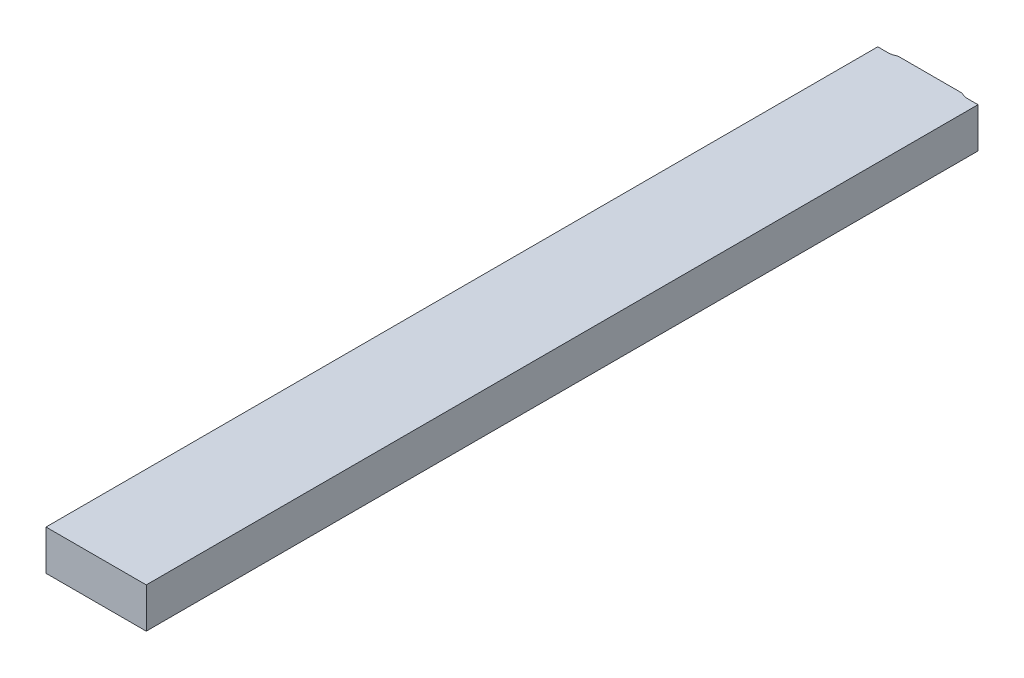
ISO-10303-21;
HEADER;
FILE_DESCRIPTION(('STEP AP214'),'2;1');
FILE_NAME('part.step','',(''),(''),'','','');
FILE_SCHEMA(('AUTOMOTIVE_DESIGN { 1 0 10303 214 1 1 1 1 }'));
ENDSEC;
DATA;
#1=APPLICATION_CONTEXT('core data for automotive mechanical design processes');
#2=APPLICATION_PROTOCOL_DEFINITION('international standard','automotive_design',2000,#1);
#3=PRODUCT_CONTEXT('',#1,'mechanical');
#4=PRODUCT('Part','Part','',(#3));
#5=PRODUCT_RELATED_PRODUCT_CATEGORY('part','',(#4));
#6=PRODUCT_DEFINITION_FORMATION('','',#4);
#7=PRODUCT_DEFINITION_CONTEXT('part definition',#1,'design');
#8=PRODUCT_DEFINITION('design','',#6,#7);
#9=PRODUCT_DEFINITION_SHAPE('','',#8);
#10=(LENGTH_UNIT() NAMED_UNIT(*) SI_UNIT(.MILLI.,.METRE.));
#11=(NAMED_UNIT(*) PLANE_ANGLE_UNIT() SI_UNIT($,.RADIAN.));
#12=(NAMED_UNIT(*) SI_UNIT($,.STERADIAN.) SOLID_ANGLE_UNIT());
#13=UNCERTAINTY_MEASURE_WITH_UNIT(LENGTH_MEASURE(1.E-05),#10,'distance_accuracy_value','');
#14=(GEOMETRIC_REPRESENTATION_CONTEXT(3) GLOBAL_UNCERTAINTY_ASSIGNED_CONTEXT((#13)) GLOBAL_UNIT_ASSIGNED_CONTEXT((#10,
#11,#12)) REPRESENTATION_CONTEXT('',''));
#15=CARTESIAN_POINT('',(0.,0.,0.));
#16=DIRECTION('',(0.,0.,1.));
#17=DIRECTION('',(1.,0.,0.));
#18=AXIS2_PLACEMENT_3D('',#15,#16,#17);
#19=CARTESIAN_POINT('',(0.5,0.275,-4.982138483571));
#20=DIRECTION('',(0.,1.,0.));
#21=DIRECTION('',(0.,0.,1.));
#22=AXIS2_PLACEMENT_3D('',#19,#20,#21);
#23=PLANE('',#22);
#24=DIRECTION('',(1.,0.,0.));
#25=VECTOR('',#24,1.);
#26=CARTESIAN_POINT('',(0.275,0.275,-7.051158663985));
#27=LINE('',#26,#25);
#28=CARTESIAN_POINT('',(0.25,0.275,-7.051158663985));
#29=VERTEX_POINT('',#28);
#30=CARTESIAN_POINT('',(0.30000000000174,0.275,-7.05115866398515));
#31=VERTEX_POINT('',#30);
#32=EDGE_CURVE('E184',#29,#31,#27,.T.);
#33=ORIENTED_EDGE('',*,*,#32,.T.);
#34=CARTESIAN_POINT('',(0.339256093821024,0.275,-7.06145062487896));
#35=CARTESIAN_POINT('',(0.335694379346151,0.275,-7.05943829430757));
#36=CARTESIAN_POINT('',(0.331976914587134,0.275,-7.05770911017002));
#37=CARTESIAN_POINT('',(0.324321331602034,0.275,-7.05483826909006));
#38=CARTESIAN_POINT('',(0.320383213307201,0.275,-7.05369661233069));
#39=CARTESIAN_POINT('',(0.311000593886995,0.275,-7.05173413514555));
#40=CARTESIAN_POINT('',(0.305503779983954,0.275,-7.05115865434738));
#41=CARTESIAN_POINT('',(0.300000000003481,0.275,-7.0511586639853));
#42=B_SPLINE_CURVE_WITH_KNOTS('',3,(#34,#35,#36,#37,#38,#39,#40,#41),.UNSPECIFIED.,.F.,.F.,(4,2,
2,4),(0.,0.0122542009828404,0.0245084057837019,0.0409766482848055),.UNSPECIFIED.);
#43=CARTESIAN_POINT('',(0.339256093821023,0.275,-7.06145062487897));
#44=VERTEX_POINT('',#43);
#45=EDGE_CURVE('E93',#44,#31,#42,.T.);
#46=ORIENTED_EDGE('',*,*,#45,.F.);
#47=DIRECTION('',(1.,0.,0.));
#48=VECTOR('',#47,1.);
#49=CARTESIAN_POINT('',(0.5000000482045,0.275,-7.061450624879));
#50=LINE('',#49,#48);
#51=CARTESIAN_POINT('',(0.660744002588045,0.275,-7.06145062487907));
#52=VERTEX_POINT('',#51);
#53=EDGE_CURVE('E89',#44,#52,#50,.T.);
#54=ORIENTED_EDGE('',*,*,#53,.T.);
#55=CARTESIAN_POINT('',(0.69999999999649,0.275,-7.05115866398509));
#56=CARTESIAN_POINT('',(0.695911207227237,0.275,-7.05116284562049));
#57=CARTESIAN_POINT('',(0.691823886666482,0.275,-7.05148113218099));
#58=CARTESIAN_POINT('',(0.683743325841821,0.275,-7.05273057454795));
#59=CARTESIAN_POINT('',(0.679750100477091,0.275,-7.0536618267458));
#60=CARTESIAN_POINT('',(0.670609172334516,0.275,-7.05654480111919));
#61=CARTESIAN_POINT('',(0.66553664971069,0.275,-7.05873731135745));
#62=CARTESIAN_POINT('',(0.660744002588091,0.275,-7.06145062487915));
#63=B_SPLINE_CURVE_WITH_KNOTS('',3,(#55,#56,#57,#58,#59,#60,#61,#62),.UNSPECIFIED.,.F.,.F.,(4,2,
2,4),(0.,0.0122527379750009,0.024507403204393,0.0409759652393866),.UNSPECIFIED.);
#64=CARTESIAN_POINT('',(0.699999999998245,0.275,-7.05115866398504));
#65=VERTEX_POINT('',#64);
#66=EDGE_CURVE('E21',#65,#52,#63,.T.);
#67=ORIENTED_EDGE('',*,*,#66,.F.);
#68=DIRECTION('',(1.,0.,0.));
#69=VECTOR('',#68,1.);
#70=CARTESIAN_POINT('',(0.725,0.275,-7.051158663985));
#71=LINE('',#70,#69);
#72=CARTESIAN_POINT('',(0.75,0.275,-7.051158663985));
#73=VERTEX_POINT('',#72);
#74=EDGE_CURVE('E84',#65,#73,#71,.T.);
#75=ORIENTED_EDGE('',*,*,#74,.T.);
#76=DIRECTION('',(0.,0.,-1.));
#77=VECTOR('',#76,1.);
#78=CARTESIAN_POINT('',(0.75,0.275,-4.976992503125));
#79=LINE('',#78,#77);
#80=CARTESIAN_POINT('',(0.75,0.275,-2.902826342264));
#81=VERTEX_POINT('',#80);
#82=EDGE_CURVE('E218',#81,#73,#79,.T.);
#83=ORIENTED_EDGE('',*,*,#82,.F.);
#84=DIRECTION('',(1.,0.,0.));
#85=VECTOR('',#84,1.);
#86=CARTESIAN_POINT('',(0.5,0.275,-2.902826342264));
#87=LINE('',#86,#85);
#88=CARTESIAN_POINT('',(0.25,0.275,-2.902826342264));
#89=VERTEX_POINT('',#88);
#90=EDGE_CURVE('E204',#89,#81,#87,.T.);
#91=ORIENTED_EDGE('',*,*,#90,.F.);
#92=DIRECTION('',(0.,0.,-1.));
#93=VECTOR('',#92,1.);
#94=CARTESIAN_POINT('',(0.25,0.275,-4.976992503125));
#95=LINE('',#94,#93);
#96=EDGE_CURVE('E176',#89,#29,#95,.T.);
#97=ORIENTED_EDGE('',*,*,#96,.T.);
#98=EDGE_LOOP('',(#33,#46,#54,#67,#75,#83,#91,#97));
#99=FACE_BOUND('',#98,.T.);
#100=ADVANCED_FACE('F17',(#99),#23,.F.);
#101=CARTESIAN_POINT('',(0.75,0.375,-4.976992503125));
#102=DIRECTION('',(1.,0.,0.));
#103=DIRECTION('',(0.,0.,-1.));
#104=AXIS2_PLACEMENT_3D('',#101,#102,#103);
#105=PLANE('',#104);
#106=DIRECTION('',(0.,0.,1.));
#107=VECTOR('',#106,1.);
#108=CARTESIAN_POINT('',(0.75,0.475,-4.982138483571));
#109=LINE('',#108,#107);
#110=CARTESIAN_POINT('',(0.75,0.475,-2.902826342264));
#111=VERTEX_POINT('',#110);
#112=CARTESIAN_POINT('',(0.75,0.475,-7.051158663985));
#113=VERTEX_POINT('',#112);
#114=EDGE_CURVE('E189',#111,#113,#109,.F.);
#115=ORIENTED_EDGE('',*,*,#114,.F.);
#116=DIRECTION('',(0.,1.,0.));
#117=VECTOR('',#116,1.);
#118=CARTESIAN_POINT('',(0.75,0.375,-2.902826342264));
#119=LINE('',#118,#117);
#120=EDGE_CURVE('E203',#81,#111,#119,.T.);
#121=ORIENTED_EDGE('',*,*,#120,.F.);
#122=ORIENTED_EDGE('',*,*,#82,.T.);
#123=DIRECTION('',(0.,1.,0.));
#124=VECTOR('',#123,1.);
#125=CARTESIAN_POINT('',(0.75,0.375,-7.051158663985));
#126=LINE('',#125,#124);
#127=EDGE_CURVE('E233',#73,#113,#126,.T.);
#128=ORIENTED_EDGE('',*,*,#127,.T.);
#129=EDGE_LOOP('',(#115,#121,#122,#128));
#130=FACE_BOUND('',#129,.T.);
#131=ADVANCED_FACE('F238',(#130),#105,.T.);
#132=CARTESIAN_POINT('',(0.725,0.375,-7.051158663985));
#133=DIRECTION('',(0.,0.,1.));
#134=DIRECTION('',(1.,0.,0.));
#135=AXIS2_PLACEMENT_3D('',#132,#133,#134);
#136=PLANE('',#135);
#137=DIRECTION('',(1.,0.,0.));
#138=VECTOR('',#137,1.);
#139=CARTESIAN_POINT('',(0.5,0.475,-7.051158663985));
#140=LINE('',#139,#138);
#141=CARTESIAN_POINT('',(0.699999926640671,0.475,-7.05115866418436));
#142=VERTEX_POINT('',#141);
#143=EDGE_CURVE('E135',#113,#142,#140,.F.);
#144=ORIENTED_EDGE('',*,*,#143,.F.);
#145=ORIENTED_EDGE('',*,*,#127,.F.);
#146=ORIENTED_EDGE('',*,*,#74,.F.);
#147=DIRECTION('',(0.,1.,0.));
#148=VECTOR('',#147,1.);
#149=CARTESIAN_POINT('',(0.7,0.2699679840491,-7.05115866398508));
#150=LINE('',#149,#148);
#151=EDGE_CURVE('E103',#142,#65,#150,.F.);
#152=ORIENTED_EDGE('',*,*,#151,.F.);
#153=EDGE_LOOP('',(#144,#145,#146,#152));
#154=FACE_BOUND('',#153,.T.);
#155=ADVANCED_FACE('F125',(#154),#136,.F.);
#156=CARTESIAN_POINT('',(0.70251960942,0.2699679840491,-7.051190309039));
#157=CARTESIAN_POINT('',(0.7016804176197,0.2699679840491,-7.051166943388));
#158=CARTESIAN_POINT('',(0.6956150023629,0.2699679840491,-7.051090682037));
#159=CARTESIAN_POINT('',(0.684291413794,0.2699679840491,-7.052195104335));
#160=CARTESIAN_POINT('',(0.6711413503349,0.2699679840491,-7.056177217872));
#161=CARTESIAN_POINT('',(0.6620241221494,0.2699679840491,-7.060613467733));
#162=CARTESIAN_POINT('',(0.6578425020674,0.2699679840491,-7.063145821386));
#163=CARTESIAN_POINT('',(0.6564337773028,0.2699679840491,-7.064061090589));
#164=(BOUNDED_CURVE() B_SPLINE_CURVE(3,(#156,#157,#158,#159,#160,#161,#162,#163),.UNSPECIFIED.,
.F.,.F.) B_SPLINE_CURVE_WITH_KNOTS((4,1,1,1,1,4),(0.,0.05196482602428,0.3752098129413,
0.6983604955043,0.8962889073985,1.),
.UNSPECIFIED.) CURVE() GEOMETRIC_REPRESENTATION_ITEM() RATIONAL_B_SPLINE_CURVE((1.,1.,1.,1.,1.,
1.,1.,1.)) REPRESENTATION_ITEM(''));
#165=DIRECTION('',(0.,1.,0.));
#166=VECTOR('',#165,1.);
#167=SURFACE_OF_LINEAR_EXTRUSION('',#164,#166);
#168=ORIENTED_EDGE('',*,*,#66,.T.);
#169=DIRECTION('',(0.,1.,0.));
#170=VECTOR('',#169,1.);
#171=CARTESIAN_POINT('',(0.660744002588,0.375,-7.061450624879));
#172=LINE('',#171,#170);
#173=CARTESIAN_POINT('',(0.660744002588,0.475,-7.061450624879));
#174=VERTEX_POINT('',#173);
#175=EDGE_CURVE('E97',#52,#174,#172,.T.);
#176=ORIENTED_EDGE('',*,*,#175,.T.);
#177=CARTESIAN_POINT('',(0.699999853281341,0.475,-7.05115866438369));
#178=CARTESIAN_POINT('',(0.695911060518289,0.475,-7.05116285322031));
#179=CARTESIAN_POINT('',(0.69182374051211,0.475,-7.05148114713333));
#180=CARTESIAN_POINT('',(0.683743181935566,0.475,-7.05273060421154));
#181=CARTESIAN_POINT('',(0.679749958264578,0.475,-7.05366186376825));
#182=CARTESIAN_POINT('',(0.670609081938422,0.475,-7.05654484039361));
#183=CARTESIAN_POINT('',(0.665536606927287,0.475,-7.05873733584118));
#184=CARTESIAN_POINT('',(0.660744002588091,0.475,-7.06145062487915));
#185=B_SPLINE_CURVE_WITH_KNOTS('',3,(#177,#178,#179,#180,#181,#182,#183,#184),.UNSPECIFIED.,.F.,
.F.,(4,2,2,4),(0.,0.0122527379884337,0.0245074032338862,0.0409758193004465),.UNSPECIFIED.);
#186=EDGE_CURVE('E129',#142,#174,#185,.T.);
#187=ORIENTED_EDGE('',*,*,#186,.F.);
#188=ORIENTED_EDGE('',*,*,#151,.T.);
#189=EDGE_LOOP('',(#168,#176,#187,#188));
#190=FACE_BOUND('',#189,.T.);
#191=ADVANCED_FACE('F100',(#190),#167,.T.);
#192=CARTESIAN_POINT('',(0.5000000482045,0.375,-7.061450624879));
#193=DIRECTION('',(0.,0.,1.));
#194=DIRECTION('',(1.,0.,0.));
#195=AXIS2_PLACEMENT_3D('',#192,#193,#194);
#196=PLANE('',#195);
#197=ORIENTED_EDGE('',*,*,#53,.F.);
#198=DIRECTION('',(0.,1.,0.));
#199=VECTOR('',#198,1.);
#200=CARTESIAN_POINT('',(0.339256093821024,0.2699679840491,-7.06145062487896));
#201=LINE('',#200,#199);
#202=CARTESIAN_POINT('',(0.339256093821022,0.475,-7.06145062487897));
#203=VERTEX_POINT('',#202);
#204=EDGE_CURVE('E109',#203,#44,#201,.F.);
#205=ORIENTED_EDGE('',*,*,#204,.F.);
#206=DIRECTION('',(1.,0.,0.));
#207=VECTOR('',#206,1.);
#208=CARTESIAN_POINT('',(0.5,0.475,-7.061450624879));
#209=LINE('',#208,#207);
#210=EDGE_CURVE('E106',#174,#203,#209,.F.);
#211=ORIENTED_EDGE('',*,*,#210,.F.);
#212=ORIENTED_EDGE('',*,*,#175,.F.);
#213=EDGE_LOOP('',(#197,#205,#211,#212));
#214=FACE_BOUND('',#213,.T.);
#215=ADVANCED_FACE('F104',(#214),#196,.F.);
#216=CARTESIAN_POINT('',(0.3435663075408,0.2699679840491,-7.064061118802));
#217=CARTESIAN_POINT('',(0.3421575862099,0.2699679840491,-7.063145841608));
#218=CARTESIAN_POINT('',(0.3379781073315,0.2699679840491,-7.060614746012));
#219=CARTESIAN_POINT('',(0.3288619848796,0.2699679840491,-7.056178456814));
#220=CARTESIAN_POINT('',(0.315712040602,0.2699679840491,-7.052195755785));
#221=CARTESIAN_POINT('',(0.3043867462711,0.2699679840491,-7.051090694486));
#222=CARTESIAN_POINT('',(0.2983211317817,0.2699679840491,-7.051166937919));
#223=CARTESIAN_POINT('',(0.2974827116361,0.2699679840491,-7.051190272618));
#224=(BOUNDED_CURVE() B_SPLINE_CURVE(3,(#216,#217,#218,#219,#220,#221,#222,#223),.UNSPECIFIED.,
.F.,.F.) B_SPLINE_CURVE_WITH_KNOTS((4,1,1,1,1,4),(0.,0.10371588788,0.301499879474,
0.6247605212805,0.9480806664219,1.),
.UNSPECIFIED.) CURVE() GEOMETRIC_REPRESENTATION_ITEM() RATIONAL_B_SPLINE_CURVE((1.,1.,1.,1.,1.,
1.,1.,1.)) REPRESENTATION_ITEM(''));
#225=DIRECTION('',(0.,1.,0.));
#226=VECTOR('',#225,1.);
#227=SURFACE_OF_LINEAR_EXTRUSION('',#224,#226);
#228=CARTESIAN_POINT('',(0.33925609382102,0.475,-7.06145062487896));
#229=CARTESIAN_POINT('',(0.335694379369032,0.475,-7.05943829433276));
#230=CARTESIAN_POINT('',(0.331976914598572,0.475,-7.05770911018262));
#231=CARTESIAN_POINT('',(0.324321331590585,0.475,-7.05483826907746));
#232=CARTESIAN_POINT('',(0.320383213284309,0.475,-7.05369661230549));
#233=CARTESIAN_POINT('',(0.311000641631788,0.475,-7.05173414515933));
#234=CARTESIAN_POINT('',(0.305503877614795,0.475,-7.05115866469179));
#235=CARTESIAN_POINT('',(0.30000014681143,0.475,-7.05115866438328));
#236=B_SPLINE_CURVE_WITH_KNOTS('',3,(#228,#229,#230,#231,#232,#233,#234,#235),.UNSPECIFIED.,.F.,
.F.,(4,2,2,4),(0.,0.0122542009828406,0.0245084057837023,0.0409765022206858),.UNSPECIFIED.);
#237=CARTESIAN_POINT('',(0.3,0.475,-7.051158663985));
#238=VERTEX_POINT('',#237);
#239=EDGE_CURVE('E136',#203,#238,#236,.T.);
#240=ORIENTED_EDGE('',*,*,#239,.F.);
#241=ORIENTED_EDGE('',*,*,#204,.T.);
#242=ORIENTED_EDGE('',*,*,#45,.T.);
#243=DIRECTION('',(0.,1.,0.));
#244=VECTOR('',#243,1.);
#245=CARTESIAN_POINT('',(0.3,0.375,-7.051158663985));
#246=LINE('',#245,#244);
#247=EDGE_CURVE('E182',#31,#238,#246,.T.);
#248=ORIENTED_EDGE('',*,*,#247,.T.);
#249=EDGE_LOOP('',(#240,#241,#242,#248));
#250=FACE_BOUND('',#249,.T.);
#251=ADVANCED_FACE('F159',(#250),#227,.T.);
#252=CARTESIAN_POINT('',(0.275,0.375,-7.051158663985));
#253=DIRECTION('',(0.,0.,1.));
#254=DIRECTION('',(1.,0.,0.));
#255=AXIS2_PLACEMENT_3D('',#252,#253,#254);
#256=PLANE('',#255);
#257=DIRECTION('',(1.,0.,0.));
#258=VECTOR('',#257,1.);
#259=CARTESIAN_POINT('',(0.5,0.475,-7.051158663985));
#260=LINE('',#259,#258);
#261=CARTESIAN_POINT('',(0.25,0.475,-7.051158663985));
#262=VERTEX_POINT('',#261);
#263=EDGE_CURVE('E181',#238,#262,#260,.F.);
#264=ORIENTED_EDGE('',*,*,#263,.F.);
#265=ORIENTED_EDGE('',*,*,#247,.F.);
#266=ORIENTED_EDGE('',*,*,#32,.F.);
#267=DIRECTION('',(0.,1.,0.));
#268=VECTOR('',#267,1.);
#269=CARTESIAN_POINT('',(0.25,0.375,-7.051158663985));
#270=LINE('',#269,#268);
#271=EDGE_CURVE('E174',#29,#262,#270,.T.);
#272=ORIENTED_EDGE('',*,*,#271,.T.);
#273=EDGE_LOOP('',(#264,#265,#266,#272));
#274=FACE_BOUND('',#273,.T.);
#275=ADVANCED_FACE('F157',(#274),#256,.F.);
#276=CARTESIAN_POINT('',(0.25,0.375,-4.976992503125));
#277=DIRECTION('',(1.,0.,0.));
#278=DIRECTION('',(0.,0.,-1.));
#279=AXIS2_PLACEMENT_3D('',#276,#277,#278);
#280=PLANE('',#279);
#281=ORIENTED_EDGE('',*,*,#271,.F.);
#282=ORIENTED_EDGE('',*,*,#96,.F.);
#283=DIRECTION('',(0.,1.,0.));
#284=VECTOR('',#283,1.);
#285=CARTESIAN_POINT('',(0.25,0.375,-2.902826342264));
#286=LINE('',#285,#284);
#287=CARTESIAN_POINT('',(0.25,0.475,-2.902826342264));
#288=VERTEX_POINT('',#287);
#289=EDGE_CURVE('E40',#288,#89,#286,.F.);
#290=ORIENTED_EDGE('',*,*,#289,.F.);
#291=DIRECTION('',(0.,0.,1.));
#292=VECTOR('',#291,1.);
#293=CARTESIAN_POINT('',(0.25,0.475,-4.982138483571));
#294=LINE('',#293,#292);
#295=EDGE_CURVE('E31',#262,#288,#294,.T.);
#296=ORIENTED_EDGE('',*,*,#295,.F.);
#297=EDGE_LOOP('',(#281,#282,#290,#296));
#298=FACE_BOUND('',#297,.T.);
#299=ADVANCED_FACE('F153',(#298),#280,.F.);
#300=CARTESIAN_POINT('',(0.5,0.375,-2.902826342264));
#301=DIRECTION('',(0.,0.,1.));
#302=DIRECTION('',(1.,0.,0.));
#303=AXIS2_PLACEMENT_3D('',#300,#301,#302);
#304=PLANE('',#303);
#305=ORIENTED_EDGE('',*,*,#120,.T.);
#306=DIRECTION('',(1.,0.,0.));
#307=VECTOR('',#306,1.);
#308=CARTESIAN_POINT('',(0.5,0.475,-2.902826342264));
#309=LINE('',#308,#307);
#310=EDGE_CURVE('E11',#288,#111,#309,.T.);
#311=ORIENTED_EDGE('',*,*,#310,.F.);
#312=ORIENTED_EDGE('',*,*,#289,.T.);
#313=ORIENTED_EDGE('',*,*,#90,.T.);
#314=EDGE_LOOP('',(#305,#311,#312,#313));
#315=FACE_BOUND('',#314,.T.);
#316=ADVANCED_FACE('F148',(#315),#304,.T.);
#317=CARTESIAN_POINT('',(0.5,0.475,-4.982138483571));
#318=DIRECTION('',(0.,1.,0.));
#319=DIRECTION('',(0.,0.,1.));
#320=AXIS2_PLACEMENT_3D('',#317,#318,#319);
#321=PLANE('',#320);
#322=ORIENTED_EDGE('',*,*,#295,.T.);
#323=ORIENTED_EDGE('',*,*,#310,.T.);
#324=ORIENTED_EDGE('',*,*,#114,.T.);
#325=ORIENTED_EDGE('',*,*,#143,.T.);
#326=ORIENTED_EDGE('',*,*,#186,.T.);
#327=ORIENTED_EDGE('',*,*,#210,.T.);
#328=ORIENTED_EDGE('',*,*,#239,.T.);
#329=ORIENTED_EDGE('',*,*,#263,.T.);
#330=EDGE_LOOP('',(#322,#323,#324,#325,#326,#327,#328,#329));
#331=FACE_BOUND('',#330,.T.);
#332=ADVANCED_FACE('F144',(#331),#321,.T.);
#333=CLOSED_SHELL('',(#100,#131,#155,#191,#215,#251,#275,#299,#316,#332));
#334=MANIFOLD_SOLID_BREP('B1',#333);
#335=ADVANCED_BREP_SHAPE_REPRESENTATION('',(#18,#334),#14);
#336=SHAPE_DEFINITION_REPRESENTATION(#9,#335);
ENDSEC;
END-ISO-10303-21;
